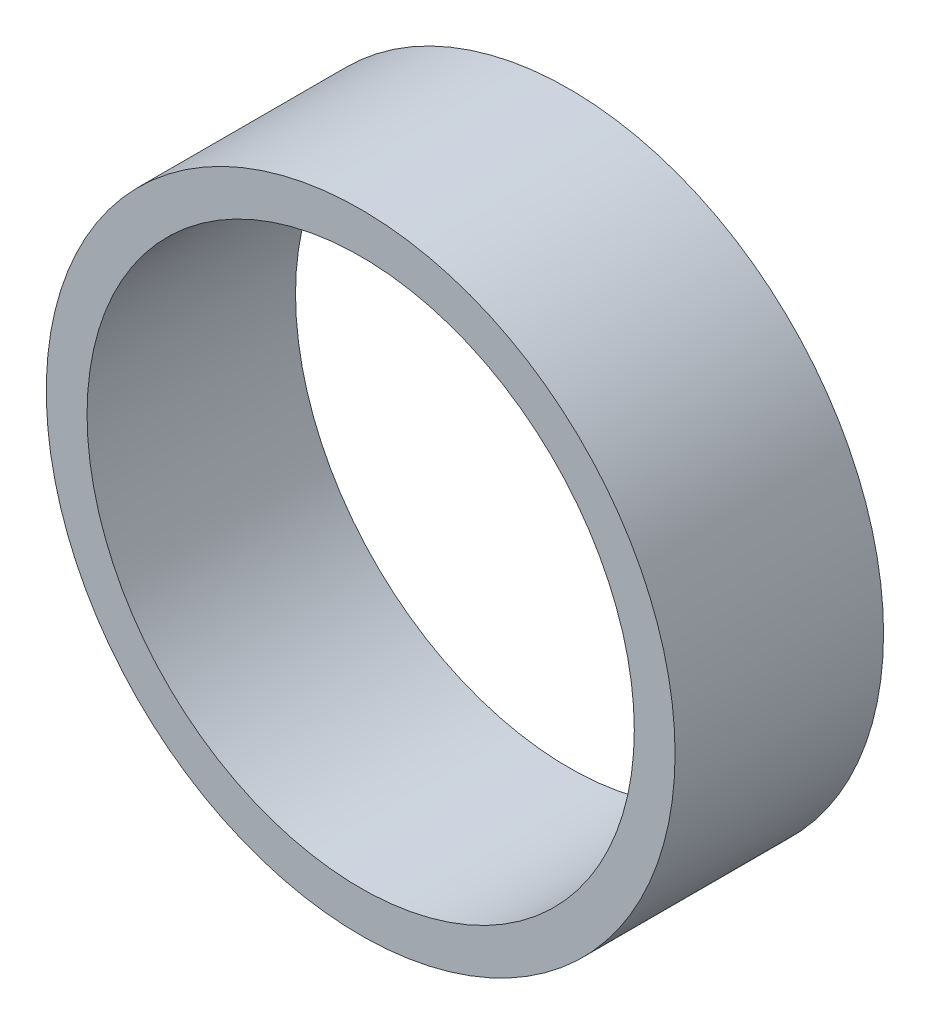
ISO-10303-21;
HEADER;
FILE_DESCRIPTION(('STEP AP214'),'2;1');
FILE_NAME('part.step','',(''),(''),'','','');
FILE_SCHEMA(('AUTOMOTIVE_DESIGN { 1 0 10303 214 1 1 1 1 }'));
ENDSEC;
DATA;
#1=APPLICATION_CONTEXT('core data for automotive mechanical design processes');
#2=APPLICATION_PROTOCOL_DEFINITION('international standard','automotive_design',2000,#1);
#3=PRODUCT_CONTEXT('',#1,'mechanical');
#4=PRODUCT('Part','Part','',(#3));
#5=PRODUCT_RELATED_PRODUCT_CATEGORY('part','',(#4));
#6=PRODUCT_DEFINITION_FORMATION('','',#4);
#7=PRODUCT_DEFINITION_CONTEXT('part definition',#1,'design');
#8=PRODUCT_DEFINITION('design','',#6,#7);
#9=PRODUCT_DEFINITION_SHAPE('','',#8);
#10=(LENGTH_UNIT() NAMED_UNIT(*) SI_UNIT(.MILLI.,.METRE.));
#11=(NAMED_UNIT(*) PLANE_ANGLE_UNIT() SI_UNIT($,.RADIAN.));
#12=(NAMED_UNIT(*) SI_UNIT($,.STERADIAN.) SOLID_ANGLE_UNIT());
#13=UNCERTAINTY_MEASURE_WITH_UNIT(LENGTH_MEASURE(1.E-05),#10,'distance_accuracy_value','');
#14=(GEOMETRIC_REPRESENTATION_CONTEXT(3) GLOBAL_UNCERTAINTY_ASSIGNED_CONTEXT((#13)) GLOBAL_UNIT_ASSIGNED_CONTEXT((#10,
#11,#12)) REPRESENTATION_CONTEXT('',''));
#15=CARTESIAN_POINT('',(0.,0.,0.));
#16=DIRECTION('',(0.,0.,1.));
#17=DIRECTION('',(1.,0.,0.));
#18=AXIS2_PLACEMENT_3D('',#15,#16,#17);
#19=CARTESIAN_POINT('',(0.,0.,10.));
#20=DIRECTION('',(0.,0.,1.));
#21=DIRECTION('',(1.,0.,0.));
#22=AXIS2_PLACEMENT_3D('',#19,#20,#21);
#23=PLANE('',#22);
#24=CARTESIAN_POINT('',(0.,0.,10.));
#25=DIRECTION('',(0.,0.,1.));
#26=DIRECTION('',(1.,0.,0.));
#27=AXIS2_PLACEMENT_3D('',#24,#25,#26);
#28=CIRCLE('',#27,30.1625);
#29=CARTESIAN_POINT('',(30.1625,0.,10.));
#30=VERTEX_POINT('',#29);
#31=EDGE_CURVE('E11',#30,#30,#28,.T.);
#32=ORIENTED_EDGE('',*,*,#31,.T.);
#33=EDGE_LOOP('',(#32));
#34=FACE_BOUND('',#33,.T.);
#35=CARTESIAN_POINT('',(0.,0.,10.));
#36=DIRECTION('',(0.,0.,1.));
#37=DIRECTION('',(1.,0.,0.));
#38=AXIS2_PLACEMENT_3D('',#35,#36,#37);
#39=CIRCLE('',#38,26.2509);
#40=CARTESIAN_POINT('',(26.2509,0.,10.));
#41=VERTEX_POINT('',#40);
#42=EDGE_CURVE('E48',#41,#41,#39,.T.);
#43=ORIENTED_EDGE('',*,*,#42,.F.);
#44=EDGE_LOOP('',(#43));
#45=FACE_BOUND('',#44,.T.);
#46=ADVANCED_FACE('F37',(#34,#45),#23,.T.);
#47=CARTESIAN_POINT('',(0.,0.,-10.));
#48=DIRECTION('',(0.,0.,1.));
#49=DIRECTION('',(1.,0.,0.));
#50=AXIS2_PLACEMENT_3D('',#47,#48,#49);
#51=PLANE('',#50);
#52=CARTESIAN_POINT('',(0.,0.,-10.));
#53=DIRECTION('',(0.,0.,1.));
#54=DIRECTION('',(1.,0.,0.));
#55=AXIS2_PLACEMENT_3D('',#52,#53,#54);
#56=CIRCLE('',#55,30.1625);
#57=CARTESIAN_POINT('',(30.1625,0.,-10.));
#58=VERTEX_POINT('',#57);
#59=EDGE_CURVE('E41',#58,#58,#56,.T.);
#60=ORIENTED_EDGE('',*,*,#59,.F.);
#61=EDGE_LOOP('',(#60));
#62=FACE_BOUND('',#61,.T.);
#63=CARTESIAN_POINT('',(0.,0.,-10.));
#64=DIRECTION('',(0.,0.,1.));
#65=DIRECTION('',(1.,0.,0.));
#66=AXIS2_PLACEMENT_3D('',#63,#64,#65);
#67=CIRCLE('',#66,26.2509);
#68=CARTESIAN_POINT('',(26.2509,0.,-10.));
#69=VERTEX_POINT('',#68);
#70=EDGE_CURVE('E50',#69,#69,#67,.T.);
#71=ORIENTED_EDGE('',*,*,#70,.T.);
#72=EDGE_LOOP('',(#71));
#73=FACE_BOUND('',#72,.T.);
#74=ADVANCED_FACE('F60',(#62,#73),#51,.F.);
#75=CARTESIAN_POINT('',(0.,0.,10.));
#76=DIRECTION('',(0.,0.,-1.));
#77=DIRECTION('',(-1.,0.,0.));
#78=AXIS2_PLACEMENT_3D('',#75,#76,#77);
#79=CYLINDRICAL_SURFACE('',#78,30.1625);
#80=ORIENTED_EDGE('',*,*,#31,.F.);
#81=EDGE_LOOP('',(#80));
#82=FACE_BOUND('',#81,.T.);
#83=ORIENTED_EDGE('',*,*,#59,.T.);
#84=EDGE_LOOP('',(#83));
#85=FACE_BOUND('',#84,.T.);
#86=ADVANCED_FACE('F39',(#82,#85),#79,.T.);
#87=CARTESIAN_POINT('',(0.,0.,10.));
#88=DIRECTION('',(0.,0.,-1.));
#89=DIRECTION('',(-1.,0.,0.));
#90=AXIS2_PLACEMENT_3D('',#87,#88,#89);
#91=CYLINDRICAL_SURFACE('',#90,26.2509);
#92=ORIENTED_EDGE('',*,*,#42,.T.);
#93=EDGE_LOOP('',(#92));
#94=FACE_BOUND('',#93,.T.);
#95=ORIENTED_EDGE('',*,*,#70,.F.);
#96=EDGE_LOOP('',(#95));
#97=FACE_BOUND('',#96,.T.);
#98=ADVANCED_FACE('F56',(#94,#97),#91,.F.);
#99=CLOSED_SHELL('',(#46,#74,#86,#98));
#100=MANIFOLD_SOLID_BREP('B2',#99);
#101=ADVANCED_BREP_SHAPE_REPRESENTATION('',(#18,#100),#14);
#102=SHAPE_DEFINITION_REPRESENTATION(#9,#101);
ENDSEC;
END-ISO-10303-21;
